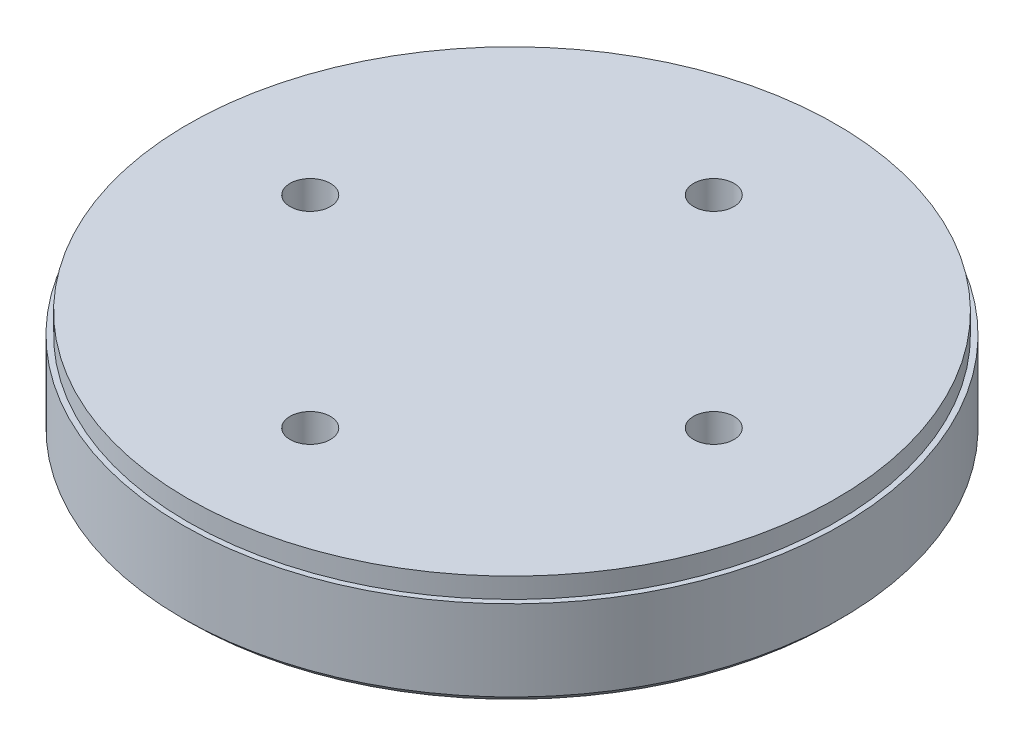
ISO-10303-21;
HEADER;
FILE_DESCRIPTION(('STEP AP214'),'2;1');
FILE_NAME('part.step','',(''),(''),'','','');
FILE_SCHEMA(('AUTOMOTIVE_DESIGN { 1 0 10303 214 1 1 1 1 }'));
ENDSEC;
DATA;
#1=APPLICATION_CONTEXT('core data for automotive mechanical design processes');
#2=APPLICATION_PROTOCOL_DEFINITION('international standard','automotive_design',2000,#1);
#3=PRODUCT_CONTEXT('',#1,'mechanical');
#4=PRODUCT('Part','Part','',(#3));
#5=PRODUCT_RELATED_PRODUCT_CATEGORY('part','',(#4));
#6=PRODUCT_DEFINITION_FORMATION('','',#4);
#7=PRODUCT_DEFINITION_CONTEXT('part definition',#1,'design');
#8=PRODUCT_DEFINITION('design','',#6,#7);
#9=PRODUCT_DEFINITION_SHAPE('','',#8);
#10=(LENGTH_UNIT() NAMED_UNIT(*) SI_UNIT(.MILLI.,.METRE.));
#11=(NAMED_UNIT(*) PLANE_ANGLE_UNIT() SI_UNIT($,.RADIAN.));
#12=(NAMED_UNIT(*) SI_UNIT($,.STERADIAN.) SOLID_ANGLE_UNIT());
#13=UNCERTAINTY_MEASURE_WITH_UNIT(LENGTH_MEASURE(1.E-05),#10,'distance_accuracy_value','');
#14=(GEOMETRIC_REPRESENTATION_CONTEXT(3) GLOBAL_UNCERTAINTY_ASSIGNED_CONTEXT((#13)) GLOBAL_UNIT_ASSIGNED_CONTEXT((#10,
#11,#12)) REPRESENTATION_CONTEXT('',''));
#15=CARTESIAN_POINT('',(0.,0.,0.));
#16=DIRECTION('',(0.,0.,1.));
#17=DIRECTION('',(1.,0.,0.));
#18=AXIS2_PLACEMENT_3D('',#15,#16,#17);
#19=CARTESIAN_POINT('',(0.,8.,0.));
#20=DIRECTION('',(0.,1.,0.));
#21=DIRECTION('',(0.,0.,1.));
#22=AXIS2_PLACEMENT_3D('',#19,#20,#21);
#23=PLANE('',#22);
#24=CARTESIAN_POINT('',(-14.9999999999996,8.,4.2632564145606E-13));
#25=DIRECTION('',(0.,1.,0.));
#26=DIRECTION('',(0.,0.,1.));
#27=AXIS2_PLACEMENT_3D('',#24,#25,#26);
#28=CIRCLE('',#27,1.50000000000068);
#29=CARTESIAN_POINT('',(-14.9999999999996,8.,1.50000000000111));
#30=VERTEX_POINT('',#29);
#31=EDGE_CURVE('E67',#30,#30,#28,.T.);
#32=ORIENTED_EDGE('',*,*,#31,.F.);
#33=EDGE_LOOP('',(#32));
#34=FACE_BOUND('',#33,.T.);
#35=CARTESIAN_POINT('',(15.0000000000004,8.,-4.24488671257339E-13));
#36=DIRECTION('',(0.,1.,0.));
#37=DIRECTION('',(0.,0.,1.));
#38=AXIS2_PLACEMENT_3D('',#35,#36,#37);
#39=CIRCLE('',#38,1.50000000000033);
#40=CARTESIAN_POINT('',(15.0000000000004,8.,1.49999999999991));
#41=VERTEX_POINT('',#40);
#42=EDGE_CURVE('E56',#41,#41,#39,.T.);
#43=ORIENTED_EDGE('',*,*,#42,.F.);
#44=EDGE_LOOP('',(#43));
#45=FACE_BOUND('',#44,.T.);
#46=CARTESIAN_POINT('',(0.,8.,-15.));
#47=DIRECTION('',(0.,1.,0.));
#48=DIRECTION('',(0.,0.,1.));
#49=AXIS2_PLACEMENT_3D('',#46,#47,#48);
#50=CIRCLE('',#49,1.5);
#51=CARTESIAN_POINT('',(0.,8.,-13.5));
#52=VERTEX_POINT('',#51);
#53=EDGE_CURVE('E43',#52,#52,#50,.T.);
#54=ORIENTED_EDGE('',*,*,#53,.F.);
#55=EDGE_LOOP('',(#54));
#56=FACE_BOUND('',#55,.T.);
#57=CARTESIAN_POINT('',(8.48977342514678E-13,8.,15.));
#58=DIRECTION('',(0.,1.,0.));
#59=DIRECTION('',(0.,0.,1.));
#60=AXIS2_PLACEMENT_3D('',#57,#58,#59);
#61=CIRCLE('',#60,1.50000000000091);
#62=CARTESIAN_POINT('',(8.48977342514678E-13,8.,16.5000000000009));
#63=VERTEX_POINT('',#62);
#64=EDGE_CURVE('E61',#63,#63,#61,.T.);
#65=ORIENTED_EDGE('',*,*,#64,.F.);
#66=EDGE_LOOP('',(#65));
#67=FACE_BOUND('',#66,.T.);
#68=CARTESIAN_POINT('',(0.,8.,0.));
#69=DIRECTION('',(0.,1.,0.));
#70=DIRECTION('',(0.,0.,1.));
#71=AXIS2_PLACEMENT_3D('',#68,#69,#70);
#72=CIRCLE('',#71,24.1);
#73=CARTESIAN_POINT('',(0.,8.,24.1));
#74=VERTEX_POINT('',#73);
#75=EDGE_CURVE('E74',#74,#74,#72,.T.);
#76=ORIENTED_EDGE('',*,*,#75,.T.);
#77=EDGE_LOOP('',(#76));
#78=FACE_BOUND('',#77,.T.);
#79=ADVANCED_FACE('F32',(#34,#45,#56,#67,#78),#23,.T.);
#80=CARTESIAN_POINT('',(0.,8.,0.));
#81=DIRECTION('',(0.,-1.,0.));
#82=DIRECTION('',(0.,0.,-1.));
#83=AXIS2_PLACEMENT_3D('',#80,#81,#82);
#84=CYLINDRICAL_SURFACE('',#83,24.5);
#85=CARTESIAN_POINT('',(0.,0.5,0.));
#86=DIRECTION('',(0.,1.,0.));
#87=DIRECTION('',(0.,0.,1.));
#88=AXIS2_PLACEMENT_3D('',#85,#86,#87);
#89=CIRCLE('',#88,24.5);
#90=CARTESIAN_POINT('',(0.,0.5,24.5));
#91=VERTEX_POINT('',#90);
#92=EDGE_CURVE('E39',#91,#91,#89,.T.);
#93=ORIENTED_EDGE('',*,*,#92,.T.);
#94=EDGE_LOOP('',(#93));
#95=FACE_BOUND('',#94,.T.);
#96=CARTESIAN_POINT('',(0.,6.5,0.));
#97=DIRECTION('',(0.,1.,0.));
#98=DIRECTION('',(0.,0.,1.));
#99=AXIS2_PLACEMENT_3D('',#96,#97,#98);
#100=CIRCLE('',#99,24.5);
#101=CARTESIAN_POINT('',(0.,6.5,24.5));
#102=VERTEX_POINT('',#101);
#103=EDGE_CURVE('E50',#102,#102,#100,.T.);
#104=ORIENTED_EDGE('',*,*,#103,.F.);
#105=EDGE_LOOP('',(#104));
#106=FACE_BOUND('',#105,.T.);
#107=ADVANCED_FACE('F90',(#95,#106),#84,.T.);
#108=CARTESIAN_POINT('',(0.,0.,0.));
#109=DIRECTION('',(0.,1.,0.));
#110=DIRECTION('',(0.,0.,1.));
#111=AXIS2_PLACEMENT_3D('',#108,#109,#110);
#112=PLANE('',#111);
#113=CARTESIAN_POINT('',(0.,0.,0.));
#114=DIRECTION('',(0.,1.,0.));
#115=DIRECTION('',(0.,0.,1.));
#116=AXIS2_PLACEMENT_3D('',#113,#114,#115);
#117=CIRCLE('',#116,24.);
#118=CARTESIAN_POINT('',(0.,0.,24.));
#119=VERTEX_POINT('',#118);
#120=EDGE_CURVE('E11',#119,#119,#117,.F.);
#121=ORIENTED_EDGE('',*,*,#120,.T.);
#122=EDGE_LOOP('',(#121));
#123=FACE_BOUND('',#122,.T.);
#124=CARTESIAN_POINT('',(0.,0.,-15.));
#125=DIRECTION('',(0.,1.,0.));
#126=DIRECTION('',(0.,0.,1.));
#127=AXIS2_PLACEMENT_3D('',#124,#125,#126);
#128=CIRCLE('',#127,1.5);
#129=CARTESIAN_POINT('',(0.,0.,-13.5));
#130=VERTEX_POINT('',#129);
#131=EDGE_CURVE('E47',#130,#130,#128,.T.);
#132=ORIENTED_EDGE('',*,*,#131,.T.);
#133=EDGE_LOOP('',(#132));
#134=FACE_BOUND('',#133,.T.);
#135=CARTESIAN_POINT('',(15.0000000000004,0.,-4.24488671257339E-13));
#136=DIRECTION('',(0.,1.,0.));
#137=DIRECTION('',(0.,0.,1.));
#138=AXIS2_PLACEMENT_3D('',#135,#136,#137);
#139=CIRCLE('',#138,1.50000000000033);
#140=CARTESIAN_POINT('',(15.0000000000004,0.,1.49999999999991));
#141=VERTEX_POINT('',#140);
#142=EDGE_CURVE('E58',#141,#141,#139,.T.);
#143=ORIENTED_EDGE('',*,*,#142,.T.);
#144=EDGE_LOOP('',(#143));
#145=FACE_BOUND('',#144,.T.);
#146=CARTESIAN_POINT('',(8.48977342514678E-13,0.,15.));
#147=DIRECTION('',(0.,1.,0.));
#148=DIRECTION('',(0.,0.,1.));
#149=AXIS2_PLACEMENT_3D('',#146,#147,#148);
#150=CIRCLE('',#149,1.50000000000091);
#151=CARTESIAN_POINT('',(8.48977342514678E-13,0.,16.5000000000009));
#152=VERTEX_POINT('',#151);
#153=EDGE_CURVE('E64',#152,#152,#150,.T.);
#154=ORIENTED_EDGE('',*,*,#153,.T.);
#155=EDGE_LOOP('',(#154));
#156=FACE_BOUND('',#155,.T.);
#157=CARTESIAN_POINT('',(-14.9999999999996,0.,4.2632564145606E-13));
#158=DIRECTION('',(0.,1.,0.));
#159=DIRECTION('',(0.,0.,1.));
#160=AXIS2_PLACEMENT_3D('',#157,#158,#159);
#161=CIRCLE('',#160,1.50000000000068);
#162=CARTESIAN_POINT('',(-14.9999999999996,0.,1.50000000000111));
#163=VERTEX_POINT('',#162);
#164=EDGE_CURVE('E53',#163,#163,#161,.T.);
#165=ORIENTED_EDGE('',*,*,#164,.T.);
#166=EDGE_LOOP('',(#165));
#167=FACE_BOUND('',#166,.T.);
#168=ADVANCED_FACE('F92',(#123,#134,#145,#156,#167),#112,.F.);
#169=CARTESIAN_POINT('',(0.,8.,-15.));
#170=DIRECTION('',(0.,-1.,0.));
#171=DIRECTION('',(0.,0.,-1.));
#172=AXIS2_PLACEMENT_3D('',#169,#170,#171);
#173=CYLINDRICAL_SURFACE('',#172,1.5);
#174=ORIENTED_EDGE('',*,*,#53,.T.);
#175=EDGE_LOOP('',(#174));
#176=FACE_BOUND('',#175,.T.);
#177=ORIENTED_EDGE('',*,*,#131,.F.);
#178=EDGE_LOOP('',(#177));
#179=FACE_BOUND('',#178,.T.);
#180=ADVANCED_FACE('F97',(#176,#179),#173,.F.);
#181=CARTESIAN_POINT('',(15.0000000000004,8.,-4.24488671257339E-13));
#182=DIRECTION('',(0.,-1.,0.));
#183=DIRECTION('',(0.,0.,-1.));
#184=AXIS2_PLACEMENT_3D('',#181,#182,#183);
#185=CYLINDRICAL_SURFACE('',#184,1.50000000000033);
#186=ORIENTED_EDGE('',*,*,#42,.T.);
#187=EDGE_LOOP('',(#186));
#188=FACE_BOUND('',#187,.T.);
#189=ORIENTED_EDGE('',*,*,#142,.F.);
#190=EDGE_LOOP('',(#189));
#191=FACE_BOUND('',#190,.T.);
#192=ADVANCED_FACE('F105',(#188,#191),#185,.F.);
#193=CARTESIAN_POINT('',(8.48977342514678E-13,8.,15.));
#194=DIRECTION('',(0.,-1.,0.));
#195=DIRECTION('',(0.,0.,-1.));
#196=AXIS2_PLACEMENT_3D('',#193,#194,#195);
#197=CYLINDRICAL_SURFACE('',#196,1.50000000000091);
#198=ORIENTED_EDGE('',*,*,#64,.T.);
#199=EDGE_LOOP('',(#198));
#200=FACE_BOUND('',#199,.T.);
#201=ORIENTED_EDGE('',*,*,#153,.F.);
#202=EDGE_LOOP('',(#201));
#203=FACE_BOUND('',#202,.T.);
#204=ADVANCED_FACE('F109',(#200,#203),#197,.F.);
#205=CARTESIAN_POINT('',(-14.9999999999996,8.,4.2632564145606E-13));
#206=DIRECTION('',(0.,-1.,0.));
#207=DIRECTION('',(0.,0.,-1.));
#208=AXIS2_PLACEMENT_3D('',#205,#206,#207);
#209=CYLINDRICAL_SURFACE('',#208,1.50000000000068);
#210=ORIENTED_EDGE('',*,*,#31,.T.);
#211=EDGE_LOOP('',(#210));
#212=FACE_BOUND('',#211,.T.);
#213=ORIENTED_EDGE('',*,*,#164,.F.);
#214=EDGE_LOOP('',(#213));
#215=FACE_BOUND('',#214,.T.);
#216=ADVANCED_FACE('F86',(#212,#215),#209,.F.);
#217=CARTESIAN_POINT('',(0.,6.5,0.));
#218=DIRECTION('',(0.,1.,0.));
#219=DIRECTION('',(0.,0.,1.));
#220=AXIS2_PLACEMENT_3D('',#217,#218,#219);
#221=PLANE('',#220);
#222=CARTESIAN_POINT('',(0.,6.5,0.));
#223=DIRECTION('',(0.,1.,0.));
#224=DIRECTION('',(0.,0.,1.));
#225=AXIS2_PLACEMENT_3D('',#222,#223,#224);
#226=CIRCLE('',#225,24.1);
#227=CARTESIAN_POINT('',(0.,6.5,24.1));
#228=VERTEX_POINT('',#227);
#229=EDGE_CURVE('E54',#228,#228,#226,.T.);
#230=ORIENTED_EDGE('',*,*,#229,.F.);
#231=EDGE_LOOP('',(#230));
#232=FACE_BOUND('',#231,.T.);
#233=ORIENTED_EDGE('',*,*,#103,.T.);
#234=EDGE_LOOP('',(#233));
#235=FACE_BOUND('',#234,.T.);
#236=ADVANCED_FACE('F83',(#232,#235),#221,.T.);
#237=CARTESIAN_POINT('',(0.,6.5,0.));
#238=DIRECTION('',(0.,1.,0.));
#239=DIRECTION('',(0.,0.,1.));
#240=AXIS2_PLACEMENT_3D('',#237,#238,#239);
#241=CYLINDRICAL_SURFACE('',#240,24.1);
#242=ORIENTED_EDGE('',*,*,#229,.T.);
#243=EDGE_LOOP('',(#242));
#244=FACE_BOUND('',#243,.T.);
#245=ORIENTED_EDGE('',*,*,#75,.F.);
#246=EDGE_LOOP('',(#245));
#247=FACE_BOUND('',#246,.T.);
#248=ADVANCED_FACE('F80',(#244,#247),#241,.T.);
#249=CARTESIAN_POINT('',(0.,0.5,0.));
#250=DIRECTION('',(0.,1.,0.));
#251=DIRECTION('',(0.,0.,1.));
#252=AXIS2_PLACEMENT_3D('',#249,#250,#251);
#253=CONICAL_SURFACE('',#252,24.5,0.785398163397455);
#254=ORIENTED_EDGE('',*,*,#120,.F.);
#255=EDGE_LOOP('',(#254));
#256=FACE_BOUND('',#255,.T.);
#257=ORIENTED_EDGE('',*,*,#92,.F.);
#258=EDGE_LOOP('',(#257));
#259=FACE_BOUND('',#258,.T.);
#260=ADVANCED_FACE('F34',(#256,#259),#253,.T.);
#261=CLOSED_SHELL('',(#79,#107,#168,#180,#192,#204,#216,#236,#248,#260));
#262=MANIFOLD_SOLID_BREP('B2',#261);
#263=ADVANCED_BREP_SHAPE_REPRESENTATION('',(#18,#262),#14);
#264=SHAPE_DEFINITION_REPRESENTATION(#9,#263);
ENDSEC;
END-ISO-10303-21;
